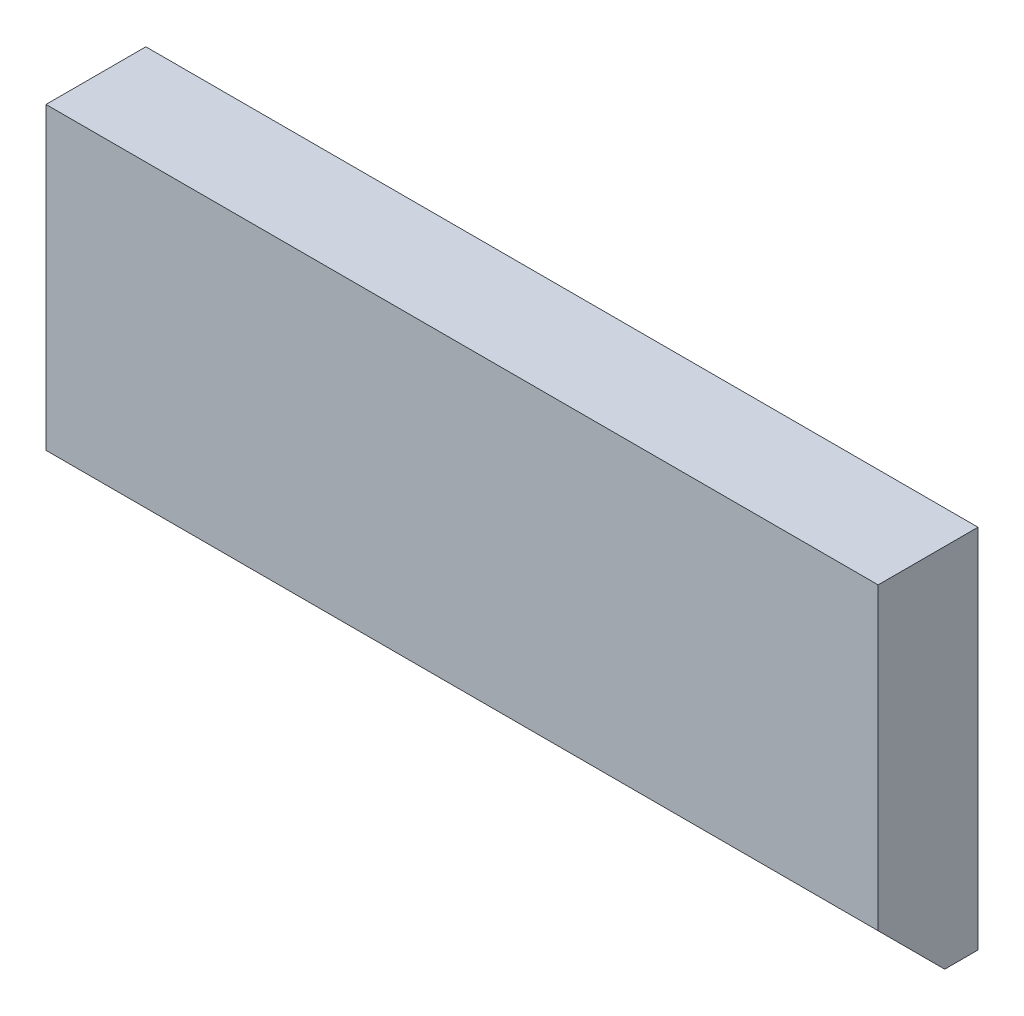
ISO-10303-21;
HEADER;
FILE_DESCRIPTION(('STEP AP214'),'2;1');
FILE_NAME('part.step','',(''),(''),'','','');
FILE_SCHEMA(('AUTOMOTIVE_DESIGN { 1 0 10303 214 1 1 1 1 }'));
ENDSEC;
DATA;
#1=APPLICATION_CONTEXT('core data for automotive mechanical design processes');
#2=APPLICATION_PROTOCOL_DEFINITION('international standard','automotive_design',2000,#1);
#3=PRODUCT_CONTEXT('',#1,'mechanical');
#4=PRODUCT('Part','Part','',(#3));
#5=PRODUCT_RELATED_PRODUCT_CATEGORY('part','',(#4));
#6=PRODUCT_DEFINITION_FORMATION('','',#4);
#7=PRODUCT_DEFINITION_CONTEXT('part definition',#1,'design');
#8=PRODUCT_DEFINITION('design','',#6,#7);
#9=PRODUCT_DEFINITION_SHAPE('','',#8);
#10=(LENGTH_UNIT() NAMED_UNIT(*) SI_UNIT(.MILLI.,.METRE.));
#11=(NAMED_UNIT(*) PLANE_ANGLE_UNIT() SI_UNIT($,.RADIAN.));
#12=(NAMED_UNIT(*) SI_UNIT($,.STERADIAN.) SOLID_ANGLE_UNIT());
#13=UNCERTAINTY_MEASURE_WITH_UNIT(LENGTH_MEASURE(1.E-05),#10,'distance_accuracy_value','');
#14=(GEOMETRIC_REPRESENTATION_CONTEXT(3) GLOBAL_UNCERTAINTY_ASSIGNED_CONTEXT((#13)) GLOBAL_UNIT_ASSIGNED_CONTEXT((#10,
#11,#12)) REPRESENTATION_CONTEXT('',''));
#15=CARTESIAN_POINT('',(0.,0.,0.));
#16=DIRECTION('',(0.,0.,1.));
#17=DIRECTION('',(1.,0.,0.));
#18=AXIS2_PLACEMENT_3D('',#15,#16,#17);
#19=CARTESIAN_POINT('',(-13.,-5.5,3.));
#20=DIRECTION('',(1.,0.,0.));
#21=DIRECTION('',(0.,0.,-1.));
#22=AXIS2_PLACEMENT_3D('',#19,#20,#21);
#23=PLANE('',#22);
#24=DIRECTION('',(0.,0.,-1.));
#25=VECTOR('',#24,1.);
#26=CARTESIAN_POINT('',(-13.,-5.5,3.));
#27=LINE('',#26,#25);
#28=CARTESIAN_POINT('',(-13.,-5.5,0.999999999999998));
#29=VERTEX_POINT('',#28);
#30=CARTESIAN_POINT('',(-13.,-5.5,0.));
#31=VERTEX_POINT('',#30);
#32=EDGE_CURVE('E114',#29,#31,#27,.T.);
#33=ORIENTED_EDGE('',*,*,#32,.F.);
#34=DIRECTION('',(0.,-0.707106781186546,-0.707106781186549));
#35=VECTOR('',#34,1.);
#36=CARTESIAN_POINT('',(-13.,-3.5,3.));
#37=LINE('',#36,#35);
#38=CARTESIAN_POINT('',(-13.,-3.5,3.));
#39=VERTEX_POINT('',#38);
#40=EDGE_CURVE('E11',#29,#39,#37,.F.);
#41=ORIENTED_EDGE('',*,*,#40,.T.);
#42=DIRECTION('',(0.,-1.,0.));
#43=VECTOR('',#42,1.);
#44=CARTESIAN_POINT('',(-13.,-5.5,3.));
#45=LINE('',#44,#43);
#46=CARTESIAN_POINT('',(-13.,5.5,3.));
#47=VERTEX_POINT('',#46);
#48=EDGE_CURVE('E85',#47,#39,#45,.T.);
#49=ORIENTED_EDGE('',*,*,#48,.F.);
#50=DIRECTION('',(0.,0.,-1.));
#51=VECTOR('',#50,1.);
#52=CARTESIAN_POINT('',(-13.,5.5,3.));
#53=LINE('',#52,#51);
#54=CARTESIAN_POINT('',(-13.,5.5,0.));
#55=VERTEX_POINT('',#54);
#56=EDGE_CURVE('E95',#47,#55,#53,.T.);
#57=ORIENTED_EDGE('',*,*,#56,.T.);
#58=DIRECTION('',(0.,-1.,0.));
#59=VECTOR('',#58,1.);
#60=CARTESIAN_POINT('',(-13.,-5.5,0.));
#61=LINE('',#60,#59);
#62=EDGE_CURVE('E104',#55,#31,#61,.T.);
#63=ORIENTED_EDGE('',*,*,#62,.T.);
#64=EDGE_LOOP('',(#33,#41,#49,#57,#63));
#65=FACE_BOUND('',#64,.T.);
#66=ADVANCED_FACE('F32',(#65),#23,.F.);
#67=CARTESIAN_POINT('',(-13.,-5.5,3.));
#68=DIRECTION('',(0.,1.,0.));
#69=DIRECTION('',(0.,0.,1.));
#70=AXIS2_PLACEMENT_3D('',#67,#68,#69);
#71=PLANE('',#70);
#72=DIRECTION('',(0.,0.,-1.));
#73=VECTOR('',#72,1.);
#74=CARTESIAN_POINT('',(12.,-5.5,3.));
#75=LINE('',#74,#73);
#76=CARTESIAN_POINT('',(12.,-5.5,0.999999999999998));
#77=VERTEX_POINT('',#76);
#78=CARTESIAN_POINT('',(12.,-5.5,0.));
#79=VERTEX_POINT('',#78);
#80=EDGE_CURVE('E94',#77,#79,#75,.T.);
#81=ORIENTED_EDGE('',*,*,#80,.F.);
#82=DIRECTION('',(-1.,0.,0.));
#83=VECTOR('',#82,1.);
#84=CARTESIAN_POINT('',(-13.,-5.5,0.999999999999998));
#85=LINE('',#84,#83);
#86=EDGE_CURVE('E40',#77,#29,#85,.T.);
#87=ORIENTED_EDGE('',*,*,#86,.T.);
#88=ORIENTED_EDGE('',*,*,#32,.T.);
#89=DIRECTION('',(1.,0.,0.));
#90=VECTOR('',#89,1.);
#91=CARTESIAN_POINT('',(-13.,-5.5,0.));
#92=LINE('',#91,#90);
#93=EDGE_CURVE('E107',#31,#79,#92,.T.);
#94=ORIENTED_EDGE('',*,*,#93,.T.);
#95=EDGE_LOOP('',(#81,#87,#88,#94));
#96=FACE_BOUND('',#95,.T.);
#97=ADVANCED_FACE('F118',(#96),#71,.F.);
#98=CARTESIAN_POINT('',(12.,-5.5,3.));
#99=DIRECTION('',(-1.,0.,0.));
#100=DIRECTION('',(0.,0.,1.));
#101=AXIS2_PLACEMENT_3D('',#98,#99,#100);
#102=PLANE('',#101);
#103=DIRECTION('',(0.,1.,0.));
#104=VECTOR('',#103,1.);
#105=CARTESIAN_POINT('',(12.,-5.5,3.));
#106=LINE('',#105,#104);
#107=CARTESIAN_POINT('',(12.,-3.5,3.));
#108=VERTEX_POINT('',#107);
#109=CARTESIAN_POINT('',(12.,5.5,3.));
#110=VERTEX_POINT('',#109);
#111=EDGE_CURVE('E76',#108,#110,#106,.T.);
#112=ORIENTED_EDGE('',*,*,#111,.F.);
#113=DIRECTION('',(0.,0.707106781186546,0.707106781186549));
#114=VECTOR('',#113,1.);
#115=CARTESIAN_POINT('',(12.,-3.5,3.));
#116=LINE('',#115,#114);
#117=EDGE_CURVE('E54',#108,#77,#116,.F.);
#118=ORIENTED_EDGE('',*,*,#117,.T.);
#119=ORIENTED_EDGE('',*,*,#80,.T.);
#120=DIRECTION('',(0.,1.,0.));
#121=VECTOR('',#120,1.);
#122=CARTESIAN_POINT('',(12.,-5.5,0.));
#123=LINE('',#122,#121);
#124=CARTESIAN_POINT('',(12.,5.5,0.));
#125=VERTEX_POINT('',#124);
#126=EDGE_CURVE('E91',#79,#125,#123,.T.);
#127=ORIENTED_EDGE('',*,*,#126,.T.);
#128=DIRECTION('',(0.,0.,-1.));
#129=VECTOR('',#128,1.);
#130=CARTESIAN_POINT('',(12.,5.5,3.));
#131=LINE('',#130,#129);
#132=EDGE_CURVE('E88',#110,#125,#131,.T.);
#133=ORIENTED_EDGE('',*,*,#132,.F.);
#134=EDGE_LOOP('',(#112,#118,#119,#127,#133));
#135=FACE_BOUND('',#134,.T.);
#136=ADVANCED_FACE('F89',(#135),#102,.F.);
#137=CARTESIAN_POINT('',(-13.,5.5,3.));
#138=DIRECTION('',(0.,-1.,0.));
#139=DIRECTION('',(0.,0.,-1.));
#140=AXIS2_PLACEMENT_3D('',#137,#138,#139);
#141=PLANE('',#140);
#142=DIRECTION('',(-1.,0.,0.));
#143=VECTOR('',#142,1.);
#144=CARTESIAN_POINT('',(-13.,5.5,0.));
#145=LINE('',#144,#143);
#146=EDGE_CURVE('E111',#125,#55,#145,.T.);
#147=ORIENTED_EDGE('',*,*,#146,.T.);
#148=ORIENTED_EDGE('',*,*,#56,.F.);
#149=DIRECTION('',(-1.,0.,0.));
#150=VECTOR('',#149,1.);
#151=CARTESIAN_POINT('',(-13.,5.5,3.));
#152=LINE('',#151,#150);
#153=EDGE_CURVE('E81',#110,#47,#152,.T.);
#154=ORIENTED_EDGE('',*,*,#153,.F.);
#155=ORIENTED_EDGE('',*,*,#132,.T.);
#156=EDGE_LOOP('',(#147,#148,#154,#155));
#157=FACE_BOUND('',#156,.T.);
#158=ADVANCED_FACE('F97',(#157),#141,.F.);
#159=CARTESIAN_POINT('',(-13.,5.5,3.));
#160=DIRECTION('',(0.,0.,-1.));
#161=DIRECTION('',(-1.,0.,0.));
#162=AXIS2_PLACEMENT_3D('',#159,#160,#161);
#163=PLANE('',#162);
#164=ORIENTED_EDGE('',*,*,#48,.T.);
#165=DIRECTION('',(1.,0.,0.));
#166=VECTOR('',#165,1.);
#167=CARTESIAN_POINT('',(-13.,-3.5,3.));
#168=LINE('',#167,#166);
#169=EDGE_CURVE('E84',#39,#108,#168,.T.);
#170=ORIENTED_EDGE('',*,*,#169,.T.);
#171=ORIENTED_EDGE('',*,*,#111,.T.);
#172=ORIENTED_EDGE('',*,*,#153,.T.);
#173=EDGE_LOOP('',(#164,#170,#171,#172));
#174=FACE_BOUND('',#173,.T.);
#175=ADVANCED_FACE('F79',(#174),#163,.F.);
#176=CARTESIAN_POINT('',(-13.,5.5,0.));
#177=DIRECTION('',(0.,0.,-1.));
#178=DIRECTION('',(-1.,0.,0.));
#179=AXIS2_PLACEMENT_3D('',#176,#177,#178);
#180=PLANE('',#179);
#181=ORIENTED_EDGE('',*,*,#62,.F.);
#182=ORIENTED_EDGE('',*,*,#146,.F.);
#183=ORIENTED_EDGE('',*,*,#126,.F.);
#184=ORIENTED_EDGE('',*,*,#93,.F.);
#185=EDGE_LOOP('',(#181,#182,#183,#184));
#186=FACE_BOUND('',#185,.T.);
#187=ADVANCED_FACE('F123',(#186),#180,.T.);
#188=CARTESIAN_POINT('',(-13.,-3.5,3.));
#189=DIRECTION('',(0.,0.707106781186549,-0.707106781186546));
#190=DIRECTION('',(0.,0.707106781186546,0.707106781186549));
#191=AXIS2_PLACEMENT_3D('',#188,#189,#190);
#192=PLANE('',#191);
#193=ORIENTED_EDGE('',*,*,#40,.F.);
#194=ORIENTED_EDGE('',*,*,#86,.F.);
#195=ORIENTED_EDGE('',*,*,#117,.F.);
#196=ORIENTED_EDGE('',*,*,#169,.F.);
#197=EDGE_LOOP('',(#193,#194,#195,#196));
#198=FACE_BOUND('',#197,.T.);
#199=ADVANCED_FACE('F34',(#198),#192,.F.);
#200=CLOSED_SHELL('',(#66,#97,#136,#158,#175,#187,#199));
#201=MANIFOLD_SOLID_BREP('B2',#200);
#202=ADVANCED_BREP_SHAPE_REPRESENTATION('',(#18,#201),#14);
#203=SHAPE_DEFINITION_REPRESENTATION(#9,#202);
ENDSEC;
END-ISO-10303-21;
